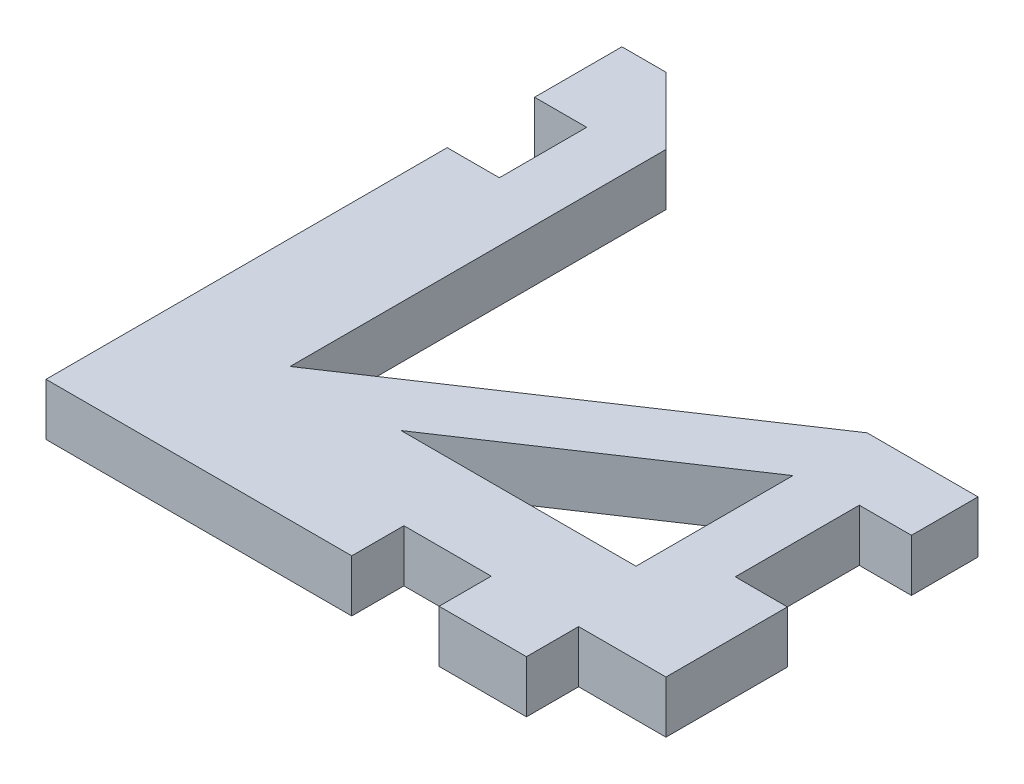
ISO-10303-21;
HEADER;
FILE_DESCRIPTION(('STEP AP214'),'2;1');
FILE_NAME('part.step','',(''),(''),'','','');
FILE_SCHEMA(('AUTOMOTIVE_DESIGN { 1 0 10303 214 1 1 1 1 }'));
ENDSEC;
DATA;
#1=APPLICATION_CONTEXT('core data for automotive mechanical design processes');
#2=APPLICATION_PROTOCOL_DEFINITION('international standard','automotive_design',2000,#1);
#3=PRODUCT_CONTEXT('',#1,'mechanical');
#4=PRODUCT('Part','Part','',(#3));
#5=PRODUCT_RELATED_PRODUCT_CATEGORY('part','',(#4));
#6=PRODUCT_DEFINITION_FORMATION('','',#4);
#7=PRODUCT_DEFINITION_CONTEXT('part definition',#1,'design');
#8=PRODUCT_DEFINITION('design','',#6,#7);
#9=PRODUCT_DEFINITION_SHAPE('','',#8);
#10=(LENGTH_UNIT() NAMED_UNIT(*) SI_UNIT(.MILLI.,.METRE.));
#11=(NAMED_UNIT(*) PLANE_ANGLE_UNIT() SI_UNIT($,.RADIAN.));
#12=(NAMED_UNIT(*) SI_UNIT($,.STERADIAN.) SOLID_ANGLE_UNIT());
#13=UNCERTAINTY_MEASURE_WITH_UNIT(LENGTH_MEASURE(1.E-05),#10,'distance_accuracy_value','');
#14=(GEOMETRIC_REPRESENTATION_CONTEXT(3) GLOBAL_UNCERTAINTY_ASSIGNED_CONTEXT((#13)) GLOBAL_UNIT_ASSIGNED_CONTEXT((#10,
#11,#12)) REPRESENTATION_CONTEXT('',''));
#15=CARTESIAN_POINT('',(0.,0.,0.));
#16=DIRECTION('',(0.,0.,1.));
#17=DIRECTION('',(1.,0.,0.));
#18=AXIS2_PLACEMENT_3D('',#15,#16,#17);
#19=CARTESIAN_POINT('',(-0.92804010199981,5.969,-30.));
#20=DIRECTION('',(-0.707106781186548,0.,0.707106781186547));
#21=DIRECTION('',(0.707106781186547,0.,0.707106781186548));
#22=AXIS2_PLACEMENT_3D('',#19,#20,#21);
#23=PLANE('',#22);
#24=DIRECTION('',(-0.707106781186547,0.,-0.707106781186548));
#25=VECTOR('',#24,1.);
#26=CARTESIAN_POINT('',(-0.92804010199981,5.969,-30.));
#27=LINE('',#26,#25);
#28=CARTESIAN_POINT('',(6.731,5.969,-22.340959898));
#29=VERTEX_POINT('',#28);
#30=CARTESIAN_POINT('',(-0.92804010199981,5.969,-30.));
#31=VERTEX_POINT('',#30);
#32=EDGE_CURVE('E319',#29,#31,#27,.T.);
#33=ORIENTED_EDGE('',*,*,#32,.F.);
#34=DIRECTION('',(0.,1.,0.));
#35=VECTOR('',#34,1.);
#36=CARTESIAN_POINT('',(6.731,0.,-22.340959898));
#37=LINE('',#36,#35);
#38=CARTESIAN_POINT('',(6.731,0.,-22.340959898));
#39=VERTEX_POINT('',#38);
#40=EDGE_CURVE('E297',#39,#29,#37,.T.);
#41=ORIENTED_EDGE('',*,*,#40,.F.);
#42=DIRECTION('',(-0.707106781186547,0.,-0.707106781186548));
#43=VECTOR('',#42,1.);
#44=CARTESIAN_POINT('',(-0.92804010199981,0.,-30.));
#45=LINE('',#44,#43);
#46=CARTESIAN_POINT('',(-0.92804010199981,0.,-30.));
#47=VERTEX_POINT('',#46);
#48=EDGE_CURVE('E342',#39,#47,#45,.T.);
#49=ORIENTED_EDGE('',*,*,#48,.T.);
#50=DIRECTION('',(0.,-1.,0.));
#51=VECTOR('',#50,1.);
#52=CARTESIAN_POINT('',(-0.92804010199981,5.969,-30.));
#53=LINE('',#52,#51);
#54=EDGE_CURVE('E369',#31,#47,#53,.T.);
#55=ORIENTED_EDGE('',*,*,#54,.F.);
#56=EDGE_LOOP('',(#33,#41,#49,#55));
#57=FACE_BOUND('',#56,.T.);
#58=ADVANCED_FACE('F32',(#57),#23,.F.);
#59=CARTESIAN_POINT('',(39.031,5.969,29.959040102));
#60=DIRECTION('',(0.,0.,-1.));
#61=DIRECTION('',(-1.,0.,0.));
#62=AXIS2_PLACEMENT_3D('',#59,#60,#61);
#63=PLANE('',#62);
#64=DIRECTION('',(1.,0.,0.));
#65=VECTOR('',#64,1.);
#66=CARTESIAN_POINT('',(39.031,0.,29.959040102));
#67=LINE('',#66,#65);
#68=CARTESIAN_POINT('',(29.031,0.,29.959040102));
#69=VERTEX_POINT('',#68);
#70=CARTESIAN_POINT('',(39.031,0.,29.959040102));
#71=VERTEX_POINT('',#70);
#72=EDGE_CURVE('E200',#69,#71,#67,.T.);
#73=ORIENTED_EDGE('',*,*,#72,.T.);
#74=DIRECTION('',(0.,-1.,0.));
#75=VECTOR('',#74,1.);
#76=CARTESIAN_POINT('',(39.031,5.969,29.959040102));
#77=LINE('',#76,#75);
#78=CARTESIAN_POINT('',(39.031,5.969,29.959040102));
#79=VERTEX_POINT('',#78);
#80=EDGE_CURVE('E11',#79,#71,#77,.T.);
#81=ORIENTED_EDGE('',*,*,#80,.F.);
#82=DIRECTION('',(1.,0.,0.));
#83=VECTOR('',#82,1.);
#84=CARTESIAN_POINT('',(39.031,5.969,29.959040102));
#85=LINE('',#84,#83);
#86=CARTESIAN_POINT('',(29.031,5.969,29.959040102));
#87=VERTEX_POINT('',#86);
#88=EDGE_CURVE('E214',#87,#79,#85,.T.);
#89=ORIENTED_EDGE('',*,*,#88,.F.);
#90=DIRECTION('',(0.,1.,0.));
#91=VECTOR('',#90,1.);
#92=CARTESIAN_POINT('',(29.031,0.,29.959040102));
#93=LINE('',#92,#91);
#94=EDGE_CURVE('E213',#69,#87,#93,.T.);
#95=ORIENTED_EDGE('',*,*,#94,.F.);
#96=EDGE_LOOP('',(#73,#81,#89,#95));
#97=FACE_BOUND('',#96,.T.);
#98=ADVANCED_FACE('F34',(#97),#63,.F.);
#99=CARTESIAN_POINT('',(39.031,5.969,35.928040102));
#100=DIRECTION('',(1.,0.,0.));
#101=DIRECTION('',(0.,0.,-1.));
#102=AXIS2_PLACEMENT_3D('',#99,#100,#101);
#103=PLANE('',#102);
#104=DIRECTION('',(0.,0.,1.));
#105=VECTOR('',#104,1.);
#106=CARTESIAN_POINT('',(39.031,0.,35.928040102));
#107=LINE('',#106,#105);
#108=CARTESIAN_POINT('',(39.031,0.,35.928040102));
#109=VERTEX_POINT('',#108);
#110=EDGE_CURVE('E208',#71,#109,#107,.T.);
#111=ORIENTED_EDGE('',*,*,#110,.T.);
#112=DIRECTION('',(0.,-1.,0.));
#113=VECTOR('',#112,1.);
#114=CARTESIAN_POINT('',(39.031,5.969,35.928040102));
#115=LINE('',#114,#113);
#116=CARTESIAN_POINT('',(39.031,5.969,35.928040102));
#117=VERTEX_POINT('',#116);
#118=EDGE_CURVE('E40',#117,#109,#115,.T.);
#119=ORIENTED_EDGE('',*,*,#118,.F.);
#120=DIRECTION('',(0.,0.,1.));
#121=VECTOR('',#120,1.);
#122=CARTESIAN_POINT('',(39.031,5.969,35.928040102));
#123=LINE('',#122,#121);
#124=EDGE_CURVE('E309',#79,#117,#123,.T.);
#125=ORIENTED_EDGE('',*,*,#124,.F.);
#126=ORIENTED_EDGE('',*,*,#80,.T.);
#127=EDGE_LOOP('',(#111,#119,#125,#126));
#128=FACE_BOUND('',#127,.T.);
#129=ADVANCED_FACE('F401',(#128),#103,.F.);
#130=CARTESIAN_POINT('',(49.031,5.969,35.928040102));
#131=DIRECTION('',(0.,0.,-1.));
#132=DIRECTION('',(-1.,0.,0.));
#133=AXIS2_PLACEMENT_3D('',#130,#131,#132);
#134=PLANE('',#133);
#135=DIRECTION('',(1.,0.,0.));
#136=VECTOR('',#135,1.);
#137=CARTESIAN_POINT('',(49.031,0.,35.928040102));
#138=LINE('',#137,#136);
#139=CARTESIAN_POINT('',(49.031,0.,35.928040102));
#140=VERTEX_POINT('',#139);
#141=EDGE_CURVE('E335',#109,#140,#138,.T.);
#142=ORIENTED_EDGE('',*,*,#141,.T.);
#143=DIRECTION('',(0.,-1.,0.));
#144=VECTOR('',#143,1.);
#145=CARTESIAN_POINT('',(49.031,5.969,35.928040102));
#146=LINE('',#145,#144);
#147=CARTESIAN_POINT('',(49.031,5.969,35.928040102));
#148=VERTEX_POINT('',#147);
#149=EDGE_CURVE('E378',#148,#140,#146,.T.);
#150=ORIENTED_EDGE('',*,*,#149,.F.);
#151=DIRECTION('',(1.,0.,0.));
#152=VECTOR('',#151,1.);
#153=CARTESIAN_POINT('',(49.031,5.969,35.928040102));
#154=LINE('',#153,#152);
#155=EDGE_CURVE('E312',#117,#148,#154,.T.);
#156=ORIENTED_EDGE('',*,*,#155,.F.);
#157=ORIENTED_EDGE('',*,*,#118,.T.);
#158=EDGE_LOOP('',(#142,#150,#156,#157));
#159=FACE_BOUND('',#158,.T.);
#160=ADVANCED_FACE('F384',(#159),#134,.F.);
#161=CARTESIAN_POINT('',(49.031,5.969,29.959040102));
#162=DIRECTION('',(-1.,0.,0.));
#163=DIRECTION('',(0.,0.,1.));
#164=AXIS2_PLACEMENT_3D('',#161,#162,#163);
#165=PLANE('',#164);
#166=DIRECTION('',(0.,0.,-1.));
#167=VECTOR('',#166,1.);
#168=CARTESIAN_POINT('',(49.031,0.,29.959040102));
#169=LINE('',#168,#167);
#170=CARTESIAN_POINT('',(49.031,0.,29.959040102));
#171=VERTEX_POINT('',#170);
#172=EDGE_CURVE('E337',#140,#171,#169,.T.);
#173=ORIENTED_EDGE('',*,*,#172,.T.);
#174=DIRECTION('',(0.,-1.,0.));
#175=VECTOR('',#174,1.);
#176=CARTESIAN_POINT('',(49.031,5.969,29.959040102));
#177=LINE('',#176,#175);
#178=CARTESIAN_POINT('',(49.031,5.969,29.959040102));
#179=VERTEX_POINT('',#178);
#180=EDGE_CURVE('E375',#179,#171,#177,.T.);
#181=ORIENTED_EDGE('',*,*,#180,.F.);
#182=DIRECTION('',(0.,0.,-1.));
#183=VECTOR('',#182,1.);
#184=CARTESIAN_POINT('',(49.031,5.969,29.959040102));
#185=LINE('',#184,#183);
#186=EDGE_CURVE('E314',#148,#179,#185,.T.);
#187=ORIENTED_EDGE('',*,*,#186,.F.);
#188=ORIENTED_EDGE('',*,*,#149,.T.);
#189=EDGE_LOOP('',(#173,#181,#187,#188));
#190=FACE_BOUND('',#189,.T.);
#191=ADVANCED_FACE('F392',(#190),#165,.F.);
#192=CARTESIAN_POINT('',(59.031,5.969,29.959040102));
#193=DIRECTION('',(0.,0.,-1.));
#194=DIRECTION('',(-1.,0.,0.));
#195=AXIS2_PLACEMENT_3D('',#192,#193,#194);
#196=PLANE('',#195);
#197=DIRECTION('',(1.,0.,0.));
#198=VECTOR('',#197,1.);
#199=CARTESIAN_POINT('',(59.031,0.,29.959040102));
#200=LINE('',#199,#198);
#201=CARTESIAN_POINT('',(59.031,0.,29.959040102));
#202=VERTEX_POINT('',#201);
#203=EDGE_CURVE('E339',#171,#202,#200,.T.);
#204=ORIENTED_EDGE('',*,*,#203,.T.);
#205=DIRECTION('',(0.,-1.,0.));
#206=VECTOR('',#205,1.);
#207=CARTESIAN_POINT('',(59.031,5.969,29.959040102));
#208=LINE('',#207,#206);
#209=CARTESIAN_POINT('',(59.031,5.969,29.959040102));
#210=VERTEX_POINT('',#209);
#211=EDGE_CURVE('E372',#210,#202,#208,.T.);
#212=ORIENTED_EDGE('',*,*,#211,.F.);
#213=DIRECTION('',(1.,0.,0.));
#214=VECTOR('',#213,1.);
#215=CARTESIAN_POINT('',(59.031,5.969,29.959040102));
#216=LINE('',#215,#214);
#217=EDGE_CURVE('E316',#179,#210,#216,.T.);
#218=ORIENTED_EDGE('',*,*,#217,.F.);
#219=ORIENTED_EDGE('',*,*,#180,.T.);
#220=EDGE_LOOP('',(#204,#212,#218,#219));
#221=FACE_BOUND('',#220,.T.);
#222=ADVANCED_FACE('F396',(#221),#196,.F.);
#223=CARTESIAN_POINT('',(-5.969,5.969,-30.));
#224=DIRECTION('',(0.,0.,1.));
#225=DIRECTION('',(1.,0.,0.));
#226=AXIS2_PLACEMENT_3D('',#223,#224,#225);
#227=PLANE('',#226);
#228=DIRECTION('',(-1.,0.,0.));
#229=VECTOR('',#228,1.);
#230=CARTESIAN_POINT('',(-5.969,0.,-30.));
#231=LINE('',#230,#229);
#232=CARTESIAN_POINT('',(-5.969,0.,-30.));
#233=VERTEX_POINT('',#232);
#234=EDGE_CURVE('E344',#47,#233,#231,.T.);
#235=ORIENTED_EDGE('',*,*,#234,.T.);
#236=DIRECTION('',(0.,-1.,0.));
#237=VECTOR('',#236,1.);
#238=CARTESIAN_POINT('',(-5.969,5.969,-30.));
#239=LINE('',#238,#237);
#240=CARTESIAN_POINT('',(-5.969,5.969,-30.));
#241=VERTEX_POINT('',#240);
#242=EDGE_CURVE('E366',#241,#233,#239,.T.);
#243=ORIENTED_EDGE('',*,*,#242,.F.);
#244=DIRECTION('',(-1.,0.,0.));
#245=VECTOR('',#244,1.);
#246=CARTESIAN_POINT('',(-5.969,5.969,-30.));
#247=LINE('',#246,#245);
#248=EDGE_CURVE('E321',#31,#241,#247,.T.);
#249=ORIENTED_EDGE('',*,*,#248,.F.);
#250=ORIENTED_EDGE('',*,*,#54,.T.);
#251=EDGE_LOOP('',(#235,#243,#249,#250));
#252=FACE_BOUND('',#251,.T.);
#253=ADVANCED_FACE('F416',(#252),#227,.F.);
#254=CARTESIAN_POINT('',(-5.969,5.969,-20.));
#255=DIRECTION('',(1.,0.,0.));
#256=DIRECTION('',(0.,0.,-1.));
#257=AXIS2_PLACEMENT_3D('',#254,#255,#256);
#258=PLANE('',#257);
#259=DIRECTION('',(0.,0.,1.));
#260=VECTOR('',#259,1.);
#261=CARTESIAN_POINT('',(-5.969,0.,-20.));
#262=LINE('',#261,#260);
#263=CARTESIAN_POINT('',(-5.969,0.,-20.));
#264=VERTEX_POINT('',#263);
#265=EDGE_CURVE('E346',#233,#264,#262,.T.);
#266=ORIENTED_EDGE('',*,*,#265,.T.);
#267=DIRECTION('',(0.,-1.,0.));
#268=VECTOR('',#267,1.);
#269=CARTESIAN_POINT('',(-5.969,5.969,-20.));
#270=LINE('',#269,#268);
#271=CARTESIAN_POINT('',(-5.969,5.969,-20.));
#272=VERTEX_POINT('',#271);
#273=EDGE_CURVE('E363',#272,#264,#270,.T.);
#274=ORIENTED_EDGE('',*,*,#273,.F.);
#275=DIRECTION('',(0.,0.,1.));
#276=VECTOR('',#275,1.);
#277=CARTESIAN_POINT('',(-5.969,5.969,-20.));
#278=LINE('',#277,#276);
#279=EDGE_CURVE('E323',#241,#272,#278,.T.);
#280=ORIENTED_EDGE('',*,*,#279,.F.);
#281=ORIENTED_EDGE('',*,*,#242,.T.);
#282=EDGE_LOOP('',(#266,#274,#280,#281));
#283=FACE_BOUND('',#282,.T.);
#284=ADVANCED_FACE('F436',(#283),#258,.F.);
#285=CARTESIAN_POINT('',(0.,5.969,-20.));
#286=DIRECTION('',(0.,0.,-1.));
#287=DIRECTION('',(-1.,0.,0.));
#288=AXIS2_PLACEMENT_3D('',#285,#286,#287);
#289=PLANE('',#288);
#290=DIRECTION('',(1.,0.,0.));
#291=VECTOR('',#290,1.);
#292=CARTESIAN_POINT('',(0.,0.,-20.));
#293=LINE('',#292,#291);
#294=CARTESIAN_POINT('',(0.,0.,-20.));
#295=VERTEX_POINT('',#294);
#296=EDGE_CURVE('E348',#264,#295,#293,.T.);
#297=ORIENTED_EDGE('',*,*,#296,.T.);
#298=DIRECTION('',(0.,-1.,0.));
#299=VECTOR('',#298,1.);
#300=CARTESIAN_POINT('',(0.,5.969,-20.));
#301=LINE('',#300,#299);
#302=CARTESIAN_POINT('',(0.,5.969,-20.));
#303=VERTEX_POINT('',#302);
#304=EDGE_CURVE('E360',#303,#295,#301,.T.);
#305=ORIENTED_EDGE('',*,*,#304,.F.);
#306=DIRECTION('',(1.,0.,0.));
#307=VECTOR('',#306,1.);
#308=CARTESIAN_POINT('',(0.,5.969,-20.));
#309=LINE('',#308,#307);
#310=EDGE_CURVE('E325',#272,#303,#309,.T.);
#311=ORIENTED_EDGE('',*,*,#310,.F.);
#312=ORIENTED_EDGE('',*,*,#273,.T.);
#313=EDGE_LOOP('',(#297,#305,#311,#312));
#314=FACE_BOUND('',#313,.T.);
#315=ADVANCED_FACE('F443',(#314),#289,.F.);
#316=CARTESIAN_POINT('',(0.,5.969,-10.));
#317=DIRECTION('',(1.,0.,0.));
#318=DIRECTION('',(0.,0.,-1.));
#319=AXIS2_PLACEMENT_3D('',#316,#317,#318);
#320=PLANE('',#319);
#321=DIRECTION('',(0.,0.,1.));
#322=VECTOR('',#321,1.);
#323=CARTESIAN_POINT('',(0.,0.,-10.));
#324=LINE('',#323,#322);
#325=CARTESIAN_POINT('',(0.,0.,-10.));
#326=VERTEX_POINT('',#325);
#327=EDGE_CURVE('E350',#295,#326,#324,.T.);
#328=ORIENTED_EDGE('',*,*,#327,.T.);
#329=DIRECTION('',(0.,-1.,0.));
#330=VECTOR('',#329,1.);
#331=CARTESIAN_POINT('',(0.,5.969,-10.));
#332=LINE('',#331,#330);
#333=CARTESIAN_POINT('',(0.,5.969,-10.));
#334=VERTEX_POINT('',#333);
#335=EDGE_CURVE('E357',#334,#326,#332,.T.);
#336=ORIENTED_EDGE('',*,*,#335,.F.);
#337=DIRECTION('',(0.,0.,1.));
#338=VECTOR('',#337,1.);
#339=CARTESIAN_POINT('',(0.,5.969,-10.));
#340=LINE('',#339,#338);
#341=EDGE_CURVE('E327',#303,#334,#340,.T.);
#342=ORIENTED_EDGE('',*,*,#341,.F.);
#343=ORIENTED_EDGE('',*,*,#304,.T.);
#344=EDGE_LOOP('',(#328,#336,#342,#343));
#345=FACE_BOUND('',#344,.T.);
#346=ADVANCED_FACE('F450',(#345),#320,.F.);
#347=CARTESIAN_POINT('',(-5.969,5.969,-10.));
#348=DIRECTION('',(0.,0.,1.));
#349=DIRECTION('',(1.,0.,0.));
#350=AXIS2_PLACEMENT_3D('',#347,#348,#349);
#351=PLANE('',#350);
#352=DIRECTION('',(-1.,0.,0.));
#353=VECTOR('',#352,1.);
#354=CARTESIAN_POINT('',(-5.969,0.,-10.));
#355=LINE('',#354,#353);
#356=CARTESIAN_POINT('',(-5.969,0.,-10.));
#357=VERTEX_POINT('',#356);
#358=EDGE_CURVE('E352',#326,#357,#355,.T.);
#359=ORIENTED_EDGE('',*,*,#358,.T.);
#360=DIRECTION('',(0.,-1.,0.));
#361=VECTOR('',#360,1.);
#362=CARTESIAN_POINT('',(-5.969,5.969,-10.));
#363=LINE('',#362,#361);
#364=CARTESIAN_POINT('',(-5.969,5.969,-10.));
#365=VERTEX_POINT('',#364);
#366=EDGE_CURVE('E332',#365,#357,#363,.T.);
#367=ORIENTED_EDGE('',*,*,#366,.F.);
#368=DIRECTION('',(-1.,0.,0.));
#369=VECTOR('',#368,1.);
#370=CARTESIAN_POINT('',(-5.969,5.969,-10.));
#371=LINE('',#370,#369);
#372=EDGE_CURVE('E329',#334,#365,#371,.T.);
#373=ORIENTED_EDGE('',*,*,#372,.F.);
#374=ORIENTED_EDGE('',*,*,#335,.T.);
#375=EDGE_LOOP('',(#359,#367,#373,#374));
#376=FACE_BOUND('',#375,.T.);
#377=ADVANCED_FACE('F458',(#376),#351,.F.);
#378=CARTESIAN_POINT('',(-5.969,5.969,0.));
#379=DIRECTION('',(1.,0.,0.));
#380=DIRECTION('',(0.,0.,-1.));
#381=AXIS2_PLACEMENT_3D('',#378,#379,#380);
#382=PLANE('',#381);
#383=DIRECTION('',(0.,0.,1.));
#384=VECTOR('',#383,1.);
#385=CARTESIAN_POINT('',(-5.969,0.,0.));
#386=LINE('',#385,#384);
#387=CARTESIAN_POINT('',(-5.96899999999999,0.,35.928040102));
#388=VERTEX_POINT('',#387);
#389=EDGE_CURVE('E310',#357,#388,#386,.T.);
#390=ORIENTED_EDGE('',*,*,#389,.T.);
#391=DIRECTION('',(0.,1.,0.));
#392=VECTOR('',#391,1.);
#393=CARTESIAN_POINT('',(-5.96899999999999,0.,35.928040102));
#394=LINE('',#393,#392);
#395=CARTESIAN_POINT('',(-5.96899999999999,5.969,35.928040102));
#396=VERTEX_POINT('',#395);
#397=EDGE_CURVE('E211',#388,#396,#394,.T.);
#398=ORIENTED_EDGE('',*,*,#397,.T.);
#399=DIRECTION('',(0.,0.,1.));
#400=VECTOR('',#399,1.);
#401=CARTESIAN_POINT('',(-5.969,5.969,0.));
#402=LINE('',#401,#400);
#403=EDGE_CURVE('E331',#365,#396,#402,.T.);
#404=ORIENTED_EDGE('',*,*,#403,.F.);
#405=ORIENTED_EDGE('',*,*,#366,.T.);
#406=EDGE_LOOP('',(#390,#398,#404,#405));
#407=FACE_BOUND('',#406,.T.);
#408=ADVANCED_FACE('F466',(#407),#382,.F.);
#409=CARTESIAN_POINT('',(0.,5.969,0.));
#410=DIRECTION('',(0.,1.,0.));
#411=DIRECTION('',(0.,0.,1.));
#412=AXIS2_PLACEMENT_3D('',#409,#410,#411);
#413=PLANE('',#412);
#414=DIRECTION('',(0.,0.,1.));
#415=VECTOR('',#414,1.);
#416=CARTESIAN_POINT('',(29.031,5.969,29.959040102));
#417=LINE('',#416,#415);
#418=CARTESIAN_POINT('',(29.031,5.969,35.928040102));
#419=VERTEX_POINT('',#418);
#420=EDGE_CURVE('E47',#87,#419,#417,.T.);
#421=ORIENTED_EDGE('',*,*,#420,.F.);
#422=ORIENTED_EDGE('',*,*,#88,.T.);
#423=ORIENTED_EDGE('',*,*,#124,.T.);
#424=ORIENTED_EDGE('',*,*,#155,.T.);
#425=ORIENTED_EDGE('',*,*,#186,.T.);
#426=ORIENTED_EDGE('',*,*,#217,.T.);
#427=DIRECTION('',(0.,0.,-1.));
#428=VECTOR('',#427,1.);
#429=CARTESIAN_POINT('',(59.031,5.969,16.059040102));
#430=LINE('',#429,#428);
#431=CARTESIAN_POINT('',(59.031,5.969,16.059040102));
#432=VERTEX_POINT('',#431);
#433=EDGE_CURVE('E236',#210,#432,#430,.T.);
#434=ORIENTED_EDGE('',*,*,#433,.T.);
#435=DIRECTION('',(-1.,0.,0.));
#436=VECTOR('',#435,1.);
#437=CARTESIAN_POINT('',(53.062,5.969,16.059040102));
#438=LINE('',#437,#436);
#439=CARTESIAN_POINT('',(53.062,5.969,16.059040102));
#440=VERTEX_POINT('',#439);
#441=EDGE_CURVE('E254',#432,#440,#438,.T.);
#442=ORIENTED_EDGE('',*,*,#441,.T.);
#443=DIRECTION('',(0.,0.,-1.));
#444=VECTOR('',#443,1.);
#445=CARTESIAN_POINT('',(53.062,5.969,1.85904010199998));
#446=LINE('',#445,#444);
#447=CARTESIAN_POINT('',(53.062,5.969,1.85904010199998));
#448=VERTEX_POINT('',#447);
#449=EDGE_CURVE('E257',#440,#448,#446,.T.);
#450=ORIENTED_EDGE('',*,*,#449,.T.);
#451=DIRECTION('',(1.,0.,0.));
#452=VECTOR('',#451,1.);
#453=CARTESIAN_POINT('',(59.031,5.969,1.85904010199998));
#454=LINE('',#453,#452);
#455=CARTESIAN_POINT('',(59.031,5.969,1.85904010199998));
#456=VERTEX_POINT('',#455);
#457=EDGE_CURVE('E260',#448,#456,#454,.T.);
#458=ORIENTED_EDGE('',*,*,#457,.T.);
#459=DIRECTION('',(0.,0.,-1.));
#460=VECTOR('',#459,1.);
#461=CARTESIAN_POINT('',(59.031,5.969,-5.76095989800002));
#462=LINE('',#461,#460);
#463=CARTESIAN_POINT('',(59.031,5.969,-5.76095989800002));
#464=VERTEX_POINT('',#463);
#465=EDGE_CURVE('E263',#456,#464,#462,.T.);
#466=ORIENTED_EDGE('',*,*,#465,.T.);
#467=DIRECTION('',(-1.,0.,0.));
#468=VECTOR('',#467,1.);
#469=CARTESIAN_POINT('',(46.331,5.969,-5.76095989800002));
#470=LINE('',#469,#468);
#471=CARTESIAN_POINT('',(46.331,5.969,-5.76095989800002));
#472=VERTEX_POINT('',#471);
#473=EDGE_CURVE('E266',#464,#472,#470,.T.);
#474=ORIENTED_EDGE('',*,*,#473,.T.);
#475=DIRECTION('',(-0.831575080545889,0.,0.555412356195915));
#476=VECTOR('',#475,1.);
#477=CARTESIAN_POINT('',(46.331,5.969,-5.76095989800002));
#478=LINE('',#477,#476);
#479=CARTESIAN_POINT('',(6.73100000000001,5.969,20.688040102));
#480=VERTEX_POINT('',#479);
#481=EDGE_CURVE('E221',#472,#480,#478,.T.);
#482=ORIENTED_EDGE('',*,*,#481,.T.);
#483=DIRECTION('',(0.,0.,1.));
#484=VECTOR('',#483,1.);
#485=CARTESIAN_POINT('',(6.731,5.969,-22.340959898));
#486=LINE('',#485,#484);
#487=EDGE_CURVE('E288',#29,#480,#486,.T.);
#488=ORIENTED_EDGE('',*,*,#487,.F.);
#489=ORIENTED_EDGE('',*,*,#32,.T.);
#490=ORIENTED_EDGE('',*,*,#248,.T.);
#491=ORIENTED_EDGE('',*,*,#279,.T.);
#492=ORIENTED_EDGE('',*,*,#310,.T.);
#493=ORIENTED_EDGE('',*,*,#341,.T.);
#494=ORIENTED_EDGE('',*,*,#372,.T.);
#495=ORIENTED_EDGE('',*,*,#403,.T.);
#496=DIRECTION('',(1.,0.,0.));
#497=VECTOR('',#496,1.);
#498=CARTESIAN_POINT('',(6.731,5.969,35.928040102));
#499=LINE('',#498,#497);
#500=EDGE_CURVE('E299',#396,#419,#499,.T.);
#501=ORIENTED_EDGE('',*,*,#500,.T.);
#502=EDGE_LOOP('',(#421,#422,#423,#424,#425,#426,#434,#442,#450,#458,#466,#474,#482,#488,#489,
#490,#491,#492,#493,#494,#495,#501));
#503=FACE_BOUND('',#502,.T.);
#504=DIRECTION('',(1.,0.,0.));
#505=VECTOR('',#504,1.);
#506=CARTESIAN_POINT('',(6.73100000000001,5.969,20.688040102));
#507=LINE('',#506,#505);
#508=CARTESIAN_POINT('',(19.431,5.969,20.688040102));
#509=VERTEX_POINT('',#508);
#510=CARTESIAN_POINT('',(46.331,5.969,20.688040102));
#511=VERTEX_POINT('',#510);
#512=EDGE_CURVE('E292',#509,#511,#507,.T.);
#513=ORIENTED_EDGE('',*,*,#512,.F.);
#514=DIRECTION('',(0.831575080545889,0.,-0.555412356195915));
#515=VECTOR('',#514,1.);
#516=CARTESIAN_POINT('',(46.331,5.969,2.72142141513129));
#517=LINE('',#516,#515);
#518=CARTESIAN_POINT('',(46.331,5.969,2.72142141513129));
#519=VERTEX_POINT('',#518);
#520=EDGE_CURVE('E229',#509,#519,#517,.T.);
#521=ORIENTED_EDGE('',*,*,#520,.T.);
#522=DIRECTION('',(0.,0.,1.));
#523=VECTOR('',#522,1.);
#524=CARTESIAN_POINT('',(46.331,5.969,20.688040102));
#525=LINE('',#524,#523);
#526=EDGE_CURVE('E269',#519,#511,#525,.T.);
#527=ORIENTED_EDGE('',*,*,#526,.T.);
#528=EDGE_LOOP('',(#513,#521,#527));
#529=FACE_BOUND('',#528,.T.);
#530=ADVANCED_FACE('F399',(#503,#529),#413,.T.);
#531=CARTESIAN_POINT('',(0.,0.,0.));
#532=DIRECTION('',(0.,1.,0.));
#533=DIRECTION('',(0.,0.,1.));
#534=AXIS2_PLACEMENT_3D('',#531,#532,#533);
#535=PLANE('',#534);
#536=DIRECTION('',(-0.831575080545889,0.,0.555412356195915));
#537=VECTOR('',#536,1.);
#538=CARTESIAN_POINT('',(46.331,0.,2.72142141513129));
#539=LINE('',#538,#537);
#540=CARTESIAN_POINT('',(46.331,0.,2.72142141513129));
#541=VERTEX_POINT('',#540);
#542=CARTESIAN_POINT('',(19.431,0.,20.688040102));
#543=VERTEX_POINT('',#542);
#544=EDGE_CURVE('E223',#541,#543,#539,.T.);
#545=ORIENTED_EDGE('',*,*,#544,.T.);
#546=DIRECTION('',(1.,0.,0.));
#547=VECTOR('',#546,1.);
#548=CARTESIAN_POINT('',(6.73100000000001,0.,20.688040102));
#549=LINE('',#548,#547);
#550=CARTESIAN_POINT('',(46.331,0.,20.688040102));
#551=VERTEX_POINT('',#550);
#552=EDGE_CURVE('E55',#543,#551,#549,.T.);
#553=ORIENTED_EDGE('',*,*,#552,.T.);
#554=DIRECTION('',(0.,0.,-1.));
#555=VECTOR('',#554,1.);
#556=CARTESIAN_POINT('',(46.331,0.,20.688040102));
#557=LINE('',#556,#555);
#558=EDGE_CURVE('E246',#551,#541,#557,.T.);
#559=ORIENTED_EDGE('',*,*,#558,.T.);
#560=EDGE_LOOP('',(#545,#553,#559));
#561=FACE_BOUND('',#560,.T.);
#562=ORIENTED_EDGE('',*,*,#72,.F.);
#563=DIRECTION('',(0.,0.,1.));
#564=VECTOR('',#563,1.);
#565=CARTESIAN_POINT('',(29.031,0.,29.959040102));
#566=LINE('',#565,#564);
#567=CARTESIAN_POINT('',(29.031,0.,35.928040102));
#568=VERTEX_POINT('',#567);
#569=EDGE_CURVE('E205',#69,#568,#566,.T.);
#570=ORIENTED_EDGE('',*,*,#569,.T.);
#571=DIRECTION('',(1.,0.,0.));
#572=VECTOR('',#571,1.);
#573=CARTESIAN_POINT('',(-5.96899999999999,0.,35.928040102));
#574=LINE('',#573,#572);
#575=EDGE_CURVE('E302',#388,#568,#574,.T.);
#576=ORIENTED_EDGE('',*,*,#575,.F.);
#577=ORIENTED_EDGE('',*,*,#389,.F.);
#578=ORIENTED_EDGE('',*,*,#358,.F.);
#579=ORIENTED_EDGE('',*,*,#327,.F.);
#580=ORIENTED_EDGE('',*,*,#296,.F.);
#581=ORIENTED_EDGE('',*,*,#265,.F.);
#582=ORIENTED_EDGE('',*,*,#234,.F.);
#583=ORIENTED_EDGE('',*,*,#48,.F.);
#584=DIRECTION('',(0.,0.,1.));
#585=VECTOR('',#584,1.);
#586=CARTESIAN_POINT('',(6.731,0.,-22.340959898));
#587=LINE('',#586,#585);
#588=CARTESIAN_POINT('',(6.73100000000001,0.,20.688040102));
#589=VERTEX_POINT('',#588);
#590=EDGE_CURVE('E289',#39,#589,#587,.T.);
#591=ORIENTED_EDGE('',*,*,#590,.T.);
#592=DIRECTION('',(0.831575080545889,0.,-0.555412356195915));
#593=VECTOR('',#592,1.);
#594=CARTESIAN_POINT('',(46.331,0.,-5.76095989800002));
#595=LINE('',#594,#593);
#596=CARTESIAN_POINT('',(46.331,0.,-5.76095989800002));
#597=VERTEX_POINT('',#596);
#598=EDGE_CURVE('E225',#589,#597,#595,.T.);
#599=ORIENTED_EDGE('',*,*,#598,.T.);
#600=DIRECTION('',(1.,0.,0.));
#601=VECTOR('',#600,1.);
#602=CARTESIAN_POINT('',(46.331,0.,-5.76095989800002));
#603=LINE('',#602,#601);
#604=CARTESIAN_POINT('',(59.031,0.,-5.76095989800002));
#605=VERTEX_POINT('',#604);
#606=EDGE_CURVE('E244',#597,#605,#603,.T.);
#607=ORIENTED_EDGE('',*,*,#606,.T.);
#608=DIRECTION('',(0.,0.,1.));
#609=VECTOR('',#608,1.);
#610=CARTESIAN_POINT('',(59.031,0.,-5.76095989800002));
#611=LINE('',#610,#609);
#612=CARTESIAN_POINT('',(59.031,0.,1.85904010199998));
#613=VERTEX_POINT('',#612);
#614=EDGE_CURVE('E242',#605,#613,#611,.T.);
#615=ORIENTED_EDGE('',*,*,#614,.T.);
#616=DIRECTION('',(-1.,0.,0.));
#617=VECTOR('',#616,1.);
#618=CARTESIAN_POINT('',(59.031,0.,1.85904010199998));
#619=LINE('',#618,#617);
#620=CARTESIAN_POINT('',(53.062,0.,1.85904010199998));
#621=VERTEX_POINT('',#620);
#622=EDGE_CURVE('E239',#613,#621,#619,.T.);
#623=ORIENTED_EDGE('',*,*,#622,.T.);
#624=DIRECTION('',(0.,0.,1.));
#625=VECTOR('',#624,1.);
#626=CARTESIAN_POINT('',(53.062,0.,1.85904010199998));
#627=LINE('',#626,#625);
#628=CARTESIAN_POINT('',(53.062,0.,16.059040102));
#629=VERTEX_POINT('',#628);
#630=EDGE_CURVE('E237',#621,#629,#627,.T.);
#631=ORIENTED_EDGE('',*,*,#630,.T.);
#632=DIRECTION('',(1.,0.,0.));
#633=VECTOR('',#632,1.);
#634=CARTESIAN_POINT('',(53.062,0.,16.059040102));
#635=LINE('',#634,#633);
#636=CARTESIAN_POINT('',(59.031,0.,16.059040102));
#637=VERTEX_POINT('',#636);
#638=EDGE_CURVE('E251',#629,#637,#635,.T.);
#639=ORIENTED_EDGE('',*,*,#638,.T.);
#640=DIRECTION('',(0.,0.,1.));
#641=VECTOR('',#640,1.);
#642=CARTESIAN_POINT('',(59.031,0.,16.059040102));
#643=LINE('',#642,#641);
#644=EDGE_CURVE('E249',#637,#202,#643,.T.);
#645=ORIENTED_EDGE('',*,*,#644,.T.);
#646=ORIENTED_EDGE('',*,*,#203,.F.);
#647=ORIENTED_EDGE('',*,*,#172,.F.);
#648=ORIENTED_EDGE('',*,*,#141,.F.);
#649=ORIENTED_EDGE('',*,*,#110,.F.);
#650=EDGE_LOOP('',(#562,#570,#576,#577,#578,#579,#580,#581,#582,#583,#591,#599,#607,#615,#623,
#631,#639,#645,#646,#647,#648,#649));
#651=FACE_BOUND('',#650,.T.);
#652=ADVANCED_FACE('F202',(#561,#651),#535,.F.);
#653=CARTESIAN_POINT('',(6.731,0.,35.928040102));
#654=DIRECTION('',(0.,0.,1.));
#655=DIRECTION('',(1.,0.,0.));
#656=AXIS2_PLACEMENT_3D('',#653,#654,#655);
#657=PLANE('',#656);
#658=DIRECTION('',(0.,1.,0.));
#659=VECTOR('',#658,1.);
#660=CARTESIAN_POINT('',(29.031,0.,35.928040102));
#661=LINE('',#660,#659);
#662=EDGE_CURVE('E215',#568,#419,#661,.T.);
#663=ORIENTED_EDGE('',*,*,#662,.T.);
#664=ORIENTED_EDGE('',*,*,#500,.F.);
#665=ORIENTED_EDGE('',*,*,#397,.F.);
#666=ORIENTED_EDGE('',*,*,#575,.T.);
#667=EDGE_LOOP('',(#663,#664,#665,#666));
#668=FACE_BOUND('',#667,.T.);
#669=ADVANCED_FACE('F488',(#668),#657,.T.);
#670=CARTESIAN_POINT('',(6.73100000000001,0.,20.688040102));
#671=DIRECTION('',(0.,0.,1.));
#672=DIRECTION('',(1.,0.,0.));
#673=AXIS2_PLACEMENT_3D('',#670,#671,#672);
#674=PLANE('',#673);
#675=ORIENTED_EDGE('',*,*,#552,.F.);
#676=DIRECTION('',(0.,1.,0.));
#677=VECTOR('',#676,1.);
#678=CARTESIAN_POINT('',(19.431,-47.620474598643,20.688040102));
#679=LINE('',#678,#677);
#680=EDGE_CURVE('E232',#543,#509,#679,.T.);
#681=ORIENTED_EDGE('',*,*,#680,.T.);
#682=ORIENTED_EDGE('',*,*,#512,.T.);
#683=DIRECTION('',(0.,1.,0.));
#684=VECTOR('',#683,1.);
#685=CARTESIAN_POINT('',(46.331,-37.9105315182998,20.688040102));
#686=LINE('',#685,#684);
#687=EDGE_CURVE('E240',#551,#511,#686,.T.);
#688=ORIENTED_EDGE('',*,*,#687,.F.);
#689=EDGE_LOOP('',(#675,#681,#682,#688));
#690=FACE_BOUND('',#689,.T.);
#691=ADVANCED_FACE('F496',(#690),#674,.F.);
#692=CARTESIAN_POINT('',(6.731,0.,-22.340959898));
#693=DIRECTION('',(-1.,0.,0.));
#694=DIRECTION('',(0.,0.,1.));
#695=AXIS2_PLACEMENT_3D('',#692,#693,#694);
#696=PLANE('',#695);
#697=ORIENTED_EDGE('',*,*,#487,.T.);
#698=DIRECTION('',(0.,1.,0.));
#699=VECTOR('',#698,1.);
#700=CARTESIAN_POINT('',(6.73100000000001,0.,20.688040102));
#701=LINE('',#700,#699);
#702=EDGE_CURVE('E294',#589,#480,#701,.T.);
#703=ORIENTED_EDGE('',*,*,#702,.F.);
#704=ORIENTED_EDGE('',*,*,#590,.F.);
#705=ORIENTED_EDGE('',*,*,#40,.T.);
#706=EDGE_LOOP('',(#697,#703,#704,#705));
#707=FACE_BOUND('',#706,.T.);
#708=ADVANCED_FACE('F505',(#707),#696,.F.);
#709=CARTESIAN_POINT('',(59.031,-37.9105315182998,16.059040102));
#710=DIRECTION('',(1.,0.,0.));
#711=DIRECTION('',(0.,0.,-1.));
#712=AXIS2_PLACEMENT_3D('',#709,#710,#711);
#713=PLANE('',#712);
#714=ORIENTED_EDGE('',*,*,#644,.F.);
#715=DIRECTION('',(0.,1.,0.));
#716=VECTOR('',#715,1.);
#717=CARTESIAN_POINT('',(59.031,-37.9105315182998,16.059040102));
#718=LINE('',#717,#716);
#719=EDGE_CURVE('E272',#637,#432,#718,.T.);
#720=ORIENTED_EDGE('',*,*,#719,.T.);
#721=ORIENTED_EDGE('',*,*,#433,.F.);
#722=ORIENTED_EDGE('',*,*,#211,.T.);
#723=EDGE_LOOP('',(#714,#720,#721,#722));
#724=FACE_BOUND('',#723,.T.);
#725=ADVANCED_FACE('F513',(#724),#713,.T.);
#726=CARTESIAN_POINT('',(46.331,-37.9105315182998,20.688040102));
#727=DIRECTION('',(-1.,0.,0.));
#728=DIRECTION('',(0.,0.,1.));
#729=AXIS2_PLACEMENT_3D('',#726,#727,#728);
#730=PLANE('',#729);
#731=DIRECTION('',(0.,1.,0.));
#732=VECTOR('',#731,1.);
#733=CARTESIAN_POINT('',(46.331,-47.620474598643,2.72142141513129));
#734=LINE('',#733,#732);
#735=EDGE_CURVE('E226',#541,#519,#734,.T.);
#736=ORIENTED_EDGE('',*,*,#735,.F.);
#737=ORIENTED_EDGE('',*,*,#558,.F.);
#738=ORIENTED_EDGE('',*,*,#687,.T.);
#739=ORIENTED_EDGE('',*,*,#526,.F.);
#740=EDGE_LOOP('',(#736,#737,#738,#739));
#741=FACE_BOUND('',#740,.T.);
#742=ADVANCED_FACE('F521',(#741),#730,.T.);
#743=CARTESIAN_POINT('',(46.331,-37.9105315182998,-5.76095989800002));
#744=DIRECTION('',(0.,0.,-1.));
#745=DIRECTION('',(-1.,0.,0.));
#746=AXIS2_PLACEMENT_3D('',#743,#744,#745);
#747=PLANE('',#746);
#748=ORIENTED_EDGE('',*,*,#606,.F.);
#749=DIRECTION('',(0.,1.,0.));
#750=VECTOR('',#749,1.);
#751=CARTESIAN_POINT('',(46.331,-37.9105315182998,-5.76095989800002));
#752=LINE('',#751,#750);
#753=EDGE_CURVE('E275',#597,#472,#752,.T.);
#754=ORIENTED_EDGE('',*,*,#753,.T.);
#755=ORIENTED_EDGE('',*,*,#473,.F.);
#756=DIRECTION('',(0.,1.,0.));
#757=VECTOR('',#756,1.);
#758=CARTESIAN_POINT('',(59.031,-37.9105315182998,-5.76095989800002));
#759=LINE('',#758,#757);
#760=EDGE_CURVE('E278',#605,#464,#759,.T.);
#761=ORIENTED_EDGE('',*,*,#760,.F.);
#762=EDGE_LOOP('',(#748,#754,#755,#761));
#763=FACE_BOUND('',#762,.T.);
#764=ADVANCED_FACE('F529',(#763),#747,.T.);
#765=CARTESIAN_POINT('',(59.031,-37.9105315182998,-5.76095989800002));
#766=DIRECTION('',(1.,0.,0.));
#767=DIRECTION('',(0.,0.,-1.));
#768=AXIS2_PLACEMENT_3D('',#765,#766,#767);
#769=PLANE('',#768);
#770=ORIENTED_EDGE('',*,*,#614,.F.);
#771=ORIENTED_EDGE('',*,*,#760,.T.);
#772=ORIENTED_EDGE('',*,*,#465,.F.);
#773=DIRECTION('',(0.,1.,0.));
#774=VECTOR('',#773,1.);
#775=CARTESIAN_POINT('',(59.031,-37.9105315182998,1.85904010199998));
#776=LINE('',#775,#774);
#777=EDGE_CURVE('E280',#613,#456,#776,.T.);
#778=ORIENTED_EDGE('',*,*,#777,.F.);
#779=EDGE_LOOP('',(#770,#771,#772,#778));
#780=FACE_BOUND('',#779,.T.);
#781=ADVANCED_FACE('F537',(#780),#769,.T.);
#782=CARTESIAN_POINT('',(59.031,-37.9105315182998,1.85904010199998));
#783=DIRECTION('',(0.,0.,1.));
#784=DIRECTION('',(1.,0.,0.));
#785=AXIS2_PLACEMENT_3D('',#782,#783,#784);
#786=PLANE('',#785);
#787=ORIENTED_EDGE('',*,*,#622,.F.);
#788=ORIENTED_EDGE('',*,*,#777,.T.);
#789=ORIENTED_EDGE('',*,*,#457,.F.);
#790=DIRECTION('',(0.,1.,0.));
#791=VECTOR('',#790,1.);
#792=CARTESIAN_POINT('',(53.062,-37.9105315182998,1.85904010199998));
#793=LINE('',#792,#791);
#794=EDGE_CURVE('E282',#621,#448,#793,.T.);
#795=ORIENTED_EDGE('',*,*,#794,.F.);
#796=EDGE_LOOP('',(#787,#788,#789,#795));
#797=FACE_BOUND('',#796,.T.);
#798=ADVANCED_FACE('F545',(#797),#786,.T.);
#799=CARTESIAN_POINT('',(53.062,-37.9105315182998,1.85904010199998));
#800=DIRECTION('',(1.,0.,0.));
#801=DIRECTION('',(0.,0.,-1.));
#802=AXIS2_PLACEMENT_3D('',#799,#800,#801);
#803=PLANE('',#802);
#804=ORIENTED_EDGE('',*,*,#630,.F.);
#805=ORIENTED_EDGE('',*,*,#794,.T.);
#806=ORIENTED_EDGE('',*,*,#449,.F.);
#807=DIRECTION('',(0.,1.,0.));
#808=VECTOR('',#807,1.);
#809=CARTESIAN_POINT('',(53.062,-37.9105315182998,16.059040102));
#810=LINE('',#809,#808);
#811=EDGE_CURVE('E284',#629,#440,#810,.T.);
#812=ORIENTED_EDGE('',*,*,#811,.F.);
#813=EDGE_LOOP('',(#804,#805,#806,#812));
#814=FACE_BOUND('',#813,.T.);
#815=ADVANCED_FACE('F553',(#814),#803,.T.);
#816=CARTESIAN_POINT('',(53.062,-37.9105315182998,16.059040102));
#817=DIRECTION('',(0.,0.,-1.));
#818=DIRECTION('',(-1.,0.,0.));
#819=AXIS2_PLACEMENT_3D('',#816,#817,#818);
#820=PLANE('',#819);
#821=ORIENTED_EDGE('',*,*,#638,.F.);
#822=ORIENTED_EDGE('',*,*,#811,.T.);
#823=ORIENTED_EDGE('',*,*,#441,.F.);
#824=ORIENTED_EDGE('',*,*,#719,.F.);
#825=EDGE_LOOP('',(#821,#822,#823,#824));
#826=FACE_BOUND('',#825,.T.);
#827=ADVANCED_FACE('F561',(#826),#820,.T.);
#828=CARTESIAN_POINT('',(46.331,-47.620474598643,2.72142141513129));
#829=DIRECTION('',(0.555412356195915,0.,0.831575080545889));
#830=DIRECTION('',(0.831575080545889,0.,-0.555412356195915));
#831=AXIS2_PLACEMENT_3D('',#828,#829,#830);
#832=PLANE('',#831);
#833=ORIENTED_EDGE('',*,*,#544,.F.);
#834=ORIENTED_EDGE('',*,*,#735,.T.);
#835=ORIENTED_EDGE('',*,*,#520,.F.);
#836=ORIENTED_EDGE('',*,*,#680,.F.);
#837=EDGE_LOOP('',(#833,#834,#835,#836));
#838=FACE_BOUND('',#837,.T.);
#839=ADVANCED_FACE('F568',(#838),#832,.T.);
#840=CARTESIAN_POINT('',(46.331,-47.620474598643,-5.76095989800002));
#841=DIRECTION('',(-0.555412356195915,0.,-0.831575080545889));
#842=DIRECTION('',(-0.831575080545889,0.,0.555412356195915));
#843=AXIS2_PLACEMENT_3D('',#840,#841,#842);
#844=PLANE('',#843);
#845=ORIENTED_EDGE('',*,*,#598,.F.);
#846=ORIENTED_EDGE('',*,*,#702,.T.);
#847=ORIENTED_EDGE('',*,*,#481,.F.);
#848=ORIENTED_EDGE('',*,*,#753,.F.);
#849=EDGE_LOOP('',(#845,#846,#847,#848));
#850=FACE_BOUND('',#849,.T.);
#851=ADVANCED_FACE('F575',(#850),#844,.T.);
#852=CARTESIAN_POINT('',(29.031,0.,29.959040102));
#853=DIRECTION('',(-1.,0.,0.));
#854=DIRECTION('',(0.,0.,1.));
#855=AXIS2_PLACEMENT_3D('',#852,#853,#854);
#856=PLANE('',#855);
#857=ORIENTED_EDGE('',*,*,#420,.T.);
#858=ORIENTED_EDGE('',*,*,#662,.F.);
#859=ORIENTED_EDGE('',*,*,#569,.F.);
#860=ORIENTED_EDGE('',*,*,#94,.T.);
#861=EDGE_LOOP('',(#857,#858,#859,#860));
#862=FACE_BOUND('',#861,.T.);
#863=ADVANCED_FACE('F217',(#862),#856,.F.);
#864=CLOSED_SHELL('',(#58,#98,#129,#160,#191,#222,#253,#284,#315,#346,#377,#408,#530,#652,#669,
#691,#708,#725,#742,#764,#781,#798,#815,#827,#839,#851,#863));
#865=MANIFOLD_SOLID_BREP('B2',#864);
#866=ADVANCED_BREP_SHAPE_REPRESENTATION('',(#18,#865),#14);
#867=SHAPE_DEFINITION_REPRESENTATION(#9,#866);
ENDSEC;
END-ISO-10303-21;
